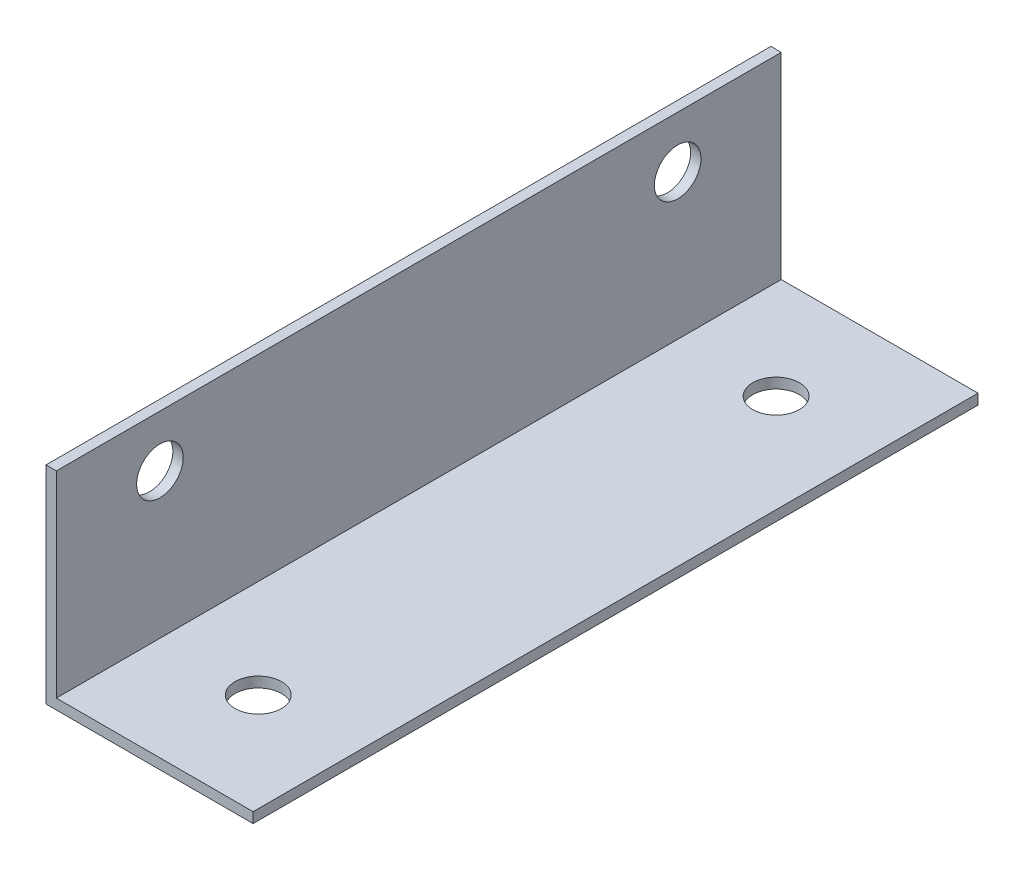
ISO-10303-21;
HEADER;
FILE_DESCRIPTION(('STEP AP214'),'2;1');
FILE_NAME('part.step','',(''),(''),'','','');
FILE_SCHEMA(('AUTOMOTIVE_DESIGN { 1 0 10303 214 1 1 1 1 }'));
ENDSEC;
DATA;
#1=APPLICATION_CONTEXT('core data for automotive mechanical design processes');
#2=APPLICATION_PROTOCOL_DEFINITION('international standard','automotive_design',2000,#1);
#3=PRODUCT_CONTEXT('',#1,'mechanical');
#4=PRODUCT('Part','Part','',(#3));
#5=PRODUCT_RELATED_PRODUCT_CATEGORY('part','',(#4));
#6=PRODUCT_DEFINITION_FORMATION('','',#4);
#7=PRODUCT_DEFINITION_CONTEXT('part definition',#1,'design');
#8=PRODUCT_DEFINITION('design','',#6,#7);
#9=PRODUCT_DEFINITION_SHAPE('','',#8);
#10=(LENGTH_UNIT() NAMED_UNIT(*) SI_UNIT(.MILLI.,.METRE.));
#11=(NAMED_UNIT(*) PLANE_ANGLE_UNIT() SI_UNIT($,.RADIAN.));
#12=(NAMED_UNIT(*) SI_UNIT($,.STERADIAN.) SOLID_ANGLE_UNIT());
#13=UNCERTAINTY_MEASURE_WITH_UNIT(LENGTH_MEASURE(1.E-05),#10,'distance_accuracy_value','');
#14=(GEOMETRIC_REPRESENTATION_CONTEXT(3) GLOBAL_UNCERTAINTY_ASSIGNED_CONTEXT((#13)) GLOBAL_UNIT_ASSIGNED_CONTEXT((#10,
#11,#12)) REPRESENTATION_CONTEXT('',''));
#15=CARTESIAN_POINT('',(0.,0.,0.));
#16=DIRECTION('',(0.,0.,1.));
#17=DIRECTION('',(1.,0.,0.));
#18=AXIS2_PLACEMENT_3D('',#15,#16,#17);
#19=CARTESIAN_POINT('',(20.,0.,70.));
#20=DIRECTION('',(0.,1.,0.));
#21=DIRECTION('',(-1.,0.,0.));
#22=AXIS2_PLACEMENT_3D('',#19,#20,#21);
#23=PLANE('',#22);
#24=CARTESIAN_POINT('',(10.5,0.,60.));
#25=DIRECTION('',(0.,1.,0.));
#26=DIRECTION('',(0.,0.,1.));
#27=AXIS2_PLACEMENT_3D('',#24,#25,#26);
#28=CIRCLE('',#27,2.25);
#29=CARTESIAN_POINT('',(10.5,0.,62.25));
#30=VERTEX_POINT('',#29);
#31=EDGE_CURVE('E168',#30,#30,#28,.T.);
#32=ORIENTED_EDGE('',*,*,#31,.T.);
#33=EDGE_LOOP('',(#32));
#34=FACE_BOUND('',#33,.T.);
#35=CARTESIAN_POINT('',(10.5,0.,10.));
#36=DIRECTION('',(0.,1.,0.));
#37=DIRECTION('',(0.,0.,1.));
#38=AXIS2_PLACEMENT_3D('',#35,#36,#37);
#39=CIRCLE('',#38,2.25);
#40=CARTESIAN_POINT('',(10.5,0.,12.25));
#41=VERTEX_POINT('',#40);
#42=EDGE_CURVE('E124',#41,#41,#39,.T.);
#43=ORIENTED_EDGE('',*,*,#42,.T.);
#44=EDGE_LOOP('',(#43));
#45=FACE_BOUND('',#44,.T.);
#46=DIRECTION('',(1.,0.,0.));
#47=VECTOR('',#46,1.);
#48=CARTESIAN_POINT('',(20.,0.,0.));
#49=LINE('',#48,#47);
#50=CARTESIAN_POINT('',(0.,0.,0.));
#51=VERTEX_POINT('',#50);
#52=CARTESIAN_POINT('',(20.,0.,0.));
#53=VERTEX_POINT('',#52);
#54=EDGE_CURVE('E120',#51,#53,#49,.T.);
#55=ORIENTED_EDGE('',*,*,#54,.T.);
#56=DIRECTION('',(0.,0.,-1.));
#57=VECTOR('',#56,1.);
#58=CARTESIAN_POINT('',(20.,0.,70.));
#59=LINE('',#58,#57);
#60=CARTESIAN_POINT('',(20.,0.,70.));
#61=VERTEX_POINT('',#60);
#62=EDGE_CURVE('E11',#61,#53,#59,.T.);
#63=ORIENTED_EDGE('',*,*,#62,.F.);
#64=DIRECTION('',(1.,0.,0.));
#65=VECTOR('',#64,1.);
#66=CARTESIAN_POINT('',(20.,0.,70.));
#67=LINE('',#66,#65);
#68=CARTESIAN_POINT('',(0.,0.,70.));
#69=VERTEX_POINT('',#68);
#70=EDGE_CURVE('E131',#69,#61,#67,.T.);
#71=ORIENTED_EDGE('',*,*,#70,.F.);
#72=DIRECTION('',(0.,0.,-1.));
#73=VECTOR('',#72,1.);
#74=CARTESIAN_POINT('',(0.,0.,70.));
#75=LINE('',#74,#73);
#76=EDGE_CURVE('E116',#69,#51,#75,.T.);
#77=ORIENTED_EDGE('',*,*,#76,.T.);
#78=EDGE_LOOP('',(#55,#63,#71,#77));
#79=FACE_BOUND('',#78,.T.);
#80=ADVANCED_FACE('F36',(#34,#45,#79),#23,.F.);
#81=CARTESIAN_POINT('',(20.,1.,70.));
#82=DIRECTION('',(-1.,0.,0.));
#83=DIRECTION('',(0.,0.,1.));
#84=AXIS2_PLACEMENT_3D('',#81,#82,#83);
#85=PLANE('',#84);
#86=DIRECTION('',(0.,1.,0.));
#87=VECTOR('',#86,1.);
#88=CARTESIAN_POINT('',(20.,1.,0.));
#89=LINE('',#88,#87);
#90=CARTESIAN_POINT('',(20.,1.,0.));
#91=VERTEX_POINT('',#90);
#92=EDGE_CURVE('E123',#53,#91,#89,.T.);
#93=ORIENTED_EDGE('',*,*,#92,.T.);
#94=DIRECTION('',(0.,0.,-1.));
#95=VECTOR('',#94,1.);
#96=CARTESIAN_POINT('',(20.,1.,70.));
#97=LINE('',#96,#95);
#98=CARTESIAN_POINT('',(20.,1.,70.));
#99=VERTEX_POINT('',#98);
#100=EDGE_CURVE('E44',#99,#91,#97,.T.);
#101=ORIENTED_EDGE('',*,*,#100,.F.);
#102=DIRECTION('',(0.,1.,0.));
#103=VECTOR('',#102,1.);
#104=CARTESIAN_POINT('',(20.,1.,70.));
#105=LINE('',#104,#103);
#106=EDGE_CURVE('E89',#61,#99,#105,.T.);
#107=ORIENTED_EDGE('',*,*,#106,.F.);
#108=ORIENTED_EDGE('',*,*,#62,.T.);
#109=EDGE_LOOP('',(#93,#101,#107,#108));
#110=FACE_BOUND('',#109,.T.);
#111=ADVANCED_FACE('F160',(#110),#85,.F.);
#112=CARTESIAN_POINT('',(1.,1.,70.));
#113=DIRECTION('',(0.,-1.,0.));
#114=DIRECTION('',(0.,0.,-1.));
#115=AXIS2_PLACEMENT_3D('',#112,#113,#114);
#116=PLANE('',#115);
#117=CARTESIAN_POINT('',(10.5,1.,60.));
#118=DIRECTION('',(0.,1.,0.));
#119=DIRECTION('',(0.,0.,1.));
#120=AXIS2_PLACEMENT_3D('',#117,#118,#119);
#121=CIRCLE('',#120,2.25);
#122=CARTESIAN_POINT('',(10.5,1.,62.25));
#123=VERTEX_POINT('',#122);
#124=EDGE_CURVE('E177',#123,#123,#121,.T.);
#125=ORIENTED_EDGE('',*,*,#124,.F.);
#126=EDGE_LOOP('',(#125));
#127=FACE_BOUND('',#126,.T.);
#128=CARTESIAN_POINT('',(10.5,1.,10.));
#129=DIRECTION('',(0.,1.,0.));
#130=DIRECTION('',(0.,0.,1.));
#131=AXIS2_PLACEMENT_3D('',#128,#129,#130);
#132=CIRCLE('',#131,2.25);
#133=CARTESIAN_POINT('',(10.5,1.,12.25));
#134=VERTEX_POINT('',#133);
#135=EDGE_CURVE('E172',#134,#134,#132,.T.);
#136=ORIENTED_EDGE('',*,*,#135,.F.);
#137=EDGE_LOOP('',(#136));
#138=FACE_BOUND('',#137,.T.);
#139=DIRECTION('',(-1.,0.,0.));
#140=VECTOR('',#139,1.);
#141=CARTESIAN_POINT('',(1.,1.,0.));
#142=LINE('',#141,#140);
#143=CARTESIAN_POINT('',(1.,1.,0.));
#144=VERTEX_POINT('',#143);
#145=EDGE_CURVE('E126',#91,#144,#142,.T.);
#146=ORIENTED_EDGE('',*,*,#145,.T.);
#147=DIRECTION('',(0.,0.,-1.));
#148=VECTOR('',#147,1.);
#149=CARTESIAN_POINT('',(1.,1.,70.));
#150=LINE('',#149,#148);
#151=CARTESIAN_POINT('',(1.,1.,70.));
#152=VERTEX_POINT('',#151);
#153=EDGE_CURVE('E111',#152,#144,#150,.T.);
#154=ORIENTED_EDGE('',*,*,#153,.F.);
#155=DIRECTION('',(-1.,0.,0.));
#156=VECTOR('',#155,1.);
#157=CARTESIAN_POINT('',(1.,1.,70.));
#158=LINE('',#157,#156);
#159=EDGE_CURVE('E102',#99,#152,#158,.T.);
#160=ORIENTED_EDGE('',*,*,#159,.F.);
#161=ORIENTED_EDGE('',*,*,#100,.T.);
#162=EDGE_LOOP('',(#146,#154,#160,#161));
#163=FACE_BOUND('',#162,.T.);
#164=ADVANCED_FACE('F137',(#127,#138,#163),#116,.F.);
#165=CARTESIAN_POINT('',(1.,20.,70.));
#166=DIRECTION('',(-1.,0.,0.));
#167=DIRECTION('',(0.,-1.,0.));
#168=AXIS2_PLACEMENT_3D('',#165,#166,#167);
#169=PLANE('',#168);
#170=CARTESIAN_POINT('',(1.,15.,60.));
#171=DIRECTION('',(1.,0.,0.));
#172=DIRECTION('',(0.,1.,0.));
#173=AXIS2_PLACEMENT_3D('',#170,#171,#172);
#174=CIRCLE('',#173,2.25);
#175=CARTESIAN_POINT('',(1.,17.25,60.));
#176=VERTEX_POINT('',#175);
#177=EDGE_CURVE('E190',#176,#176,#174,.T.);
#178=ORIENTED_EDGE('',*,*,#177,.F.);
#179=EDGE_LOOP('',(#178));
#180=FACE_BOUND('',#179,.T.);
#181=CARTESIAN_POINT('',(1.,15.,10.));
#182=DIRECTION('',(1.,0.,0.));
#183=DIRECTION('',(0.,1.,0.));
#184=AXIS2_PLACEMENT_3D('',#181,#182,#183);
#185=CIRCLE('',#184,2.25);
#186=CARTESIAN_POINT('',(1.,17.25,10.));
#187=VERTEX_POINT('',#186);
#188=EDGE_CURVE('E184',#187,#187,#185,.T.);
#189=ORIENTED_EDGE('',*,*,#188,.F.);
#190=EDGE_LOOP('',(#189));
#191=FACE_BOUND('',#190,.T.);
#192=DIRECTION('',(0.,1.,0.));
#193=VECTOR('',#192,1.);
#194=CARTESIAN_POINT('',(1.,20.,0.));
#195=LINE('',#194,#193);
#196=CARTESIAN_POINT('',(1.,20.,0.));
#197=VERTEX_POINT('',#196);
#198=EDGE_CURVE('E110',#144,#197,#195,.T.);
#199=ORIENTED_EDGE('',*,*,#198,.T.);
#200=DIRECTION('',(0.,0.,-1.));
#201=VECTOR('',#200,1.);
#202=CARTESIAN_POINT('',(1.,20.,70.));
#203=LINE('',#202,#201);
#204=CARTESIAN_POINT('',(1.,20.,70.));
#205=VERTEX_POINT('',#204);
#206=EDGE_CURVE('E107',#205,#197,#203,.T.);
#207=ORIENTED_EDGE('',*,*,#206,.F.);
#208=DIRECTION('',(0.,1.,0.));
#209=VECTOR('',#208,1.);
#210=CARTESIAN_POINT('',(1.,20.,70.));
#211=LINE('',#210,#209);
#212=EDGE_CURVE('E96',#152,#205,#211,.T.);
#213=ORIENTED_EDGE('',*,*,#212,.F.);
#214=ORIENTED_EDGE('',*,*,#153,.T.);
#215=EDGE_LOOP('',(#199,#207,#213,#214));
#216=FACE_BOUND('',#215,.T.);
#217=ADVANCED_FACE('F108',(#180,#191,#216),#169,.F.);
#218=CARTESIAN_POINT('',(0.,20.,70.));
#219=DIRECTION('',(0.,-1.,0.));
#220=DIRECTION('',(0.,0.,-1.));
#221=AXIS2_PLACEMENT_3D('',#218,#219,#220);
#222=PLANE('',#221);
#223=DIRECTION('',(-1.,0.,0.));
#224=VECTOR('',#223,1.);
#225=CARTESIAN_POINT('',(0.,20.,0.));
#226=LINE('',#225,#224);
#227=CARTESIAN_POINT('',(0.,20.,0.));
#228=VERTEX_POINT('',#227);
#229=EDGE_CURVE('E75',#197,#228,#226,.T.);
#230=ORIENTED_EDGE('',*,*,#229,.T.);
#231=DIRECTION('',(0.,0.,-1.));
#232=VECTOR('',#231,1.);
#233=CARTESIAN_POINT('',(0.,20.,70.));
#234=LINE('',#233,#232);
#235=CARTESIAN_POINT('',(0.,20.,70.));
#236=VERTEX_POINT('',#235);
#237=EDGE_CURVE('E112',#236,#228,#234,.T.);
#238=ORIENTED_EDGE('',*,*,#237,.F.);
#239=DIRECTION('',(-1.,0.,0.));
#240=VECTOR('',#239,1.);
#241=CARTESIAN_POINT('',(0.,20.,70.));
#242=LINE('',#241,#240);
#243=EDGE_CURVE('E100',#205,#236,#242,.T.);
#244=ORIENTED_EDGE('',*,*,#243,.F.);
#245=ORIENTED_EDGE('',*,*,#206,.T.);
#246=EDGE_LOOP('',(#230,#238,#244,#245));
#247=FACE_BOUND('',#246,.T.);
#248=ADVANCED_FACE('F114',(#247),#222,.F.);
#249=CARTESIAN_POINT('',(0.,0.,70.));
#250=DIRECTION('',(1.,0.,0.));
#251=DIRECTION('',(0.,0.,-1.));
#252=AXIS2_PLACEMENT_3D('',#249,#250,#251);
#253=PLANE('',#252);
#254=CARTESIAN_POINT('',(0.,15.,60.));
#255=DIRECTION('',(1.,0.,0.));
#256=DIRECTION('',(0.,1.,0.));
#257=AXIS2_PLACEMENT_3D('',#254,#255,#256);
#258=CIRCLE('',#257,2.25);
#259=CARTESIAN_POINT('',(0.,17.25,60.));
#260=VERTEX_POINT('',#259);
#261=EDGE_CURVE('E187',#260,#260,#258,.T.);
#262=ORIENTED_EDGE('',*,*,#261,.T.);
#263=EDGE_LOOP('',(#262));
#264=FACE_BOUND('',#263,.T.);
#265=CARTESIAN_POINT('',(0.,15.,10.));
#266=DIRECTION('',(1.,0.,0.));
#267=DIRECTION('',(0.,1.,0.));
#268=AXIS2_PLACEMENT_3D('',#265,#266,#267);
#269=CIRCLE('',#268,2.25);
#270=CARTESIAN_POINT('',(0.,17.25,10.));
#271=VERTEX_POINT('',#270);
#272=EDGE_CURVE('E182',#271,#271,#269,.T.);
#273=ORIENTED_EDGE('',*,*,#272,.T.);
#274=EDGE_LOOP('',(#273));
#275=FACE_BOUND('',#274,.T.);
#276=DIRECTION('',(0.,-1.,0.));
#277=VECTOR('',#276,1.);
#278=CARTESIAN_POINT('',(0.,0.,0.));
#279=LINE('',#278,#277);
#280=EDGE_CURVE('E81',#228,#51,#279,.T.);
#281=ORIENTED_EDGE('',*,*,#280,.T.);
#282=ORIENTED_EDGE('',*,*,#76,.F.);
#283=DIRECTION('',(0.,-1.,0.));
#284=VECTOR('',#283,1.);
#285=CARTESIAN_POINT('',(0.,0.,70.));
#286=LINE('',#285,#284);
#287=EDGE_CURVE('E52',#236,#69,#286,.T.);
#288=ORIENTED_EDGE('',*,*,#287,.F.);
#289=ORIENTED_EDGE('',*,*,#237,.T.);
#290=EDGE_LOOP('',(#281,#282,#288,#289));
#291=FACE_BOUND('',#290,.T.);
#292=ADVANCED_FACE('F144',(#264,#275,#291),#253,.F.);
#293=CARTESIAN_POINT('',(0.,0.,70.));
#294=DIRECTION('',(0.,0.,-1.));
#295=DIRECTION('',(-1.,0.,0.));
#296=AXIS2_PLACEMENT_3D('',#293,#294,#295);
#297=PLANE('',#296);
#298=ORIENTED_EDGE('',*,*,#70,.T.);
#299=ORIENTED_EDGE('',*,*,#106,.T.);
#300=ORIENTED_EDGE('',*,*,#159,.T.);
#301=ORIENTED_EDGE('',*,*,#212,.T.);
#302=ORIENTED_EDGE('',*,*,#243,.T.);
#303=ORIENTED_EDGE('',*,*,#287,.T.);
#304=EDGE_LOOP('',(#298,#299,#300,#301,#302,#303));
#305=FACE_BOUND('',#304,.T.);
#306=ADVANCED_FACE('F98',(#305),#297,.F.);
#307=CARTESIAN_POINT('',(0.,0.,0.));
#308=DIRECTION('',(0.,0.,-1.));
#309=DIRECTION('',(-1.,0.,0.));
#310=AXIS2_PLACEMENT_3D('',#307,#308,#309);
#311=PLANE('',#310);
#312=ORIENTED_EDGE('',*,*,#54,.F.);
#313=ORIENTED_EDGE('',*,*,#280,.F.);
#314=ORIENTED_EDGE('',*,*,#229,.F.);
#315=ORIENTED_EDGE('',*,*,#198,.F.);
#316=ORIENTED_EDGE('',*,*,#145,.F.);
#317=ORIENTED_EDGE('',*,*,#92,.F.);
#318=EDGE_LOOP('',(#312,#313,#314,#315,#316,#317));
#319=FACE_BOUND('',#318,.T.);
#320=ADVANCED_FACE('F140',(#319),#311,.T.);
#321=CARTESIAN_POINT('',(10.5,0.,10.));
#322=DIRECTION('',(0.,1.,0.));
#323=DIRECTION('',(0.,0.,1.));
#324=AXIS2_PLACEMENT_3D('',#321,#322,#323);
#325=CYLINDRICAL_SURFACE('',#324,2.25);
#326=ORIENTED_EDGE('',*,*,#42,.F.);
#327=EDGE_LOOP('',(#326));
#328=FACE_BOUND('',#327,.T.);
#329=ORIENTED_EDGE('',*,*,#135,.T.);
#330=EDGE_LOOP('',(#329));
#331=FACE_BOUND('',#330,.T.);
#332=ADVANCED_FACE('F212',(#328,#331),#325,.F.);
#333=CARTESIAN_POINT('',(10.5,0.,60.));
#334=DIRECTION('',(0.,1.,0.));
#335=DIRECTION('',(0.,0.,1.));
#336=AXIS2_PLACEMENT_3D('',#333,#334,#335);
#337=CYLINDRICAL_SURFACE('',#336,2.25);
#338=ORIENTED_EDGE('',*,*,#31,.F.);
#339=EDGE_LOOP('',(#338));
#340=FACE_BOUND('',#339,.T.);
#341=ORIENTED_EDGE('',*,*,#124,.T.);
#342=EDGE_LOOP('',(#341));
#343=FACE_BOUND('',#342,.T.);
#344=ADVANCED_FACE('F207',(#340,#343),#337,.F.);
#345=CARTESIAN_POINT('',(0.,15.,10.));
#346=DIRECTION('',(1.,0.,0.));
#347=DIRECTION('',(0.,1.,0.));
#348=AXIS2_PLACEMENT_3D('',#345,#346,#347);
#349=CYLINDRICAL_SURFACE('',#348,2.25);
#350=ORIENTED_EDGE('',*,*,#272,.F.);
#351=EDGE_LOOP('',(#350));
#352=FACE_BOUND('',#351,.T.);
#353=ORIENTED_EDGE('',*,*,#188,.T.);
#354=EDGE_LOOP('',(#353));
#355=FACE_BOUND('',#354,.T.);
#356=ADVANCED_FACE('F198',(#352,#355),#349,.F.);
#357=CARTESIAN_POINT('',(0.,15.,60.));
#358=DIRECTION('',(1.,0.,0.));
#359=DIRECTION('',(0.,1.,0.));
#360=AXIS2_PLACEMENT_3D('',#357,#358,#359);
#361=CYLINDRICAL_SURFACE('',#360,2.25);
#362=ORIENTED_EDGE('',*,*,#261,.F.);
#363=EDGE_LOOP('',(#362));
#364=FACE_BOUND('',#363,.T.);
#365=ORIENTED_EDGE('',*,*,#177,.T.);
#366=EDGE_LOOP('',(#365));
#367=FACE_BOUND('',#366,.T.);
#368=ADVANCED_FACE('F195',(#364,#367),#361,.F.);
#369=CLOSED_SHELL('',(#80,#111,#164,#217,#248,#292,#306,#320,#332,#344,#356,#368));
#370=MANIFOLD_SOLID_BREP('B2',#369);
#371=ADVANCED_BREP_SHAPE_REPRESENTATION('',(#18,#370),#14);
#372=SHAPE_DEFINITION_REPRESENTATION(#9,#371);
ENDSEC;
END-ISO-10303-21;
